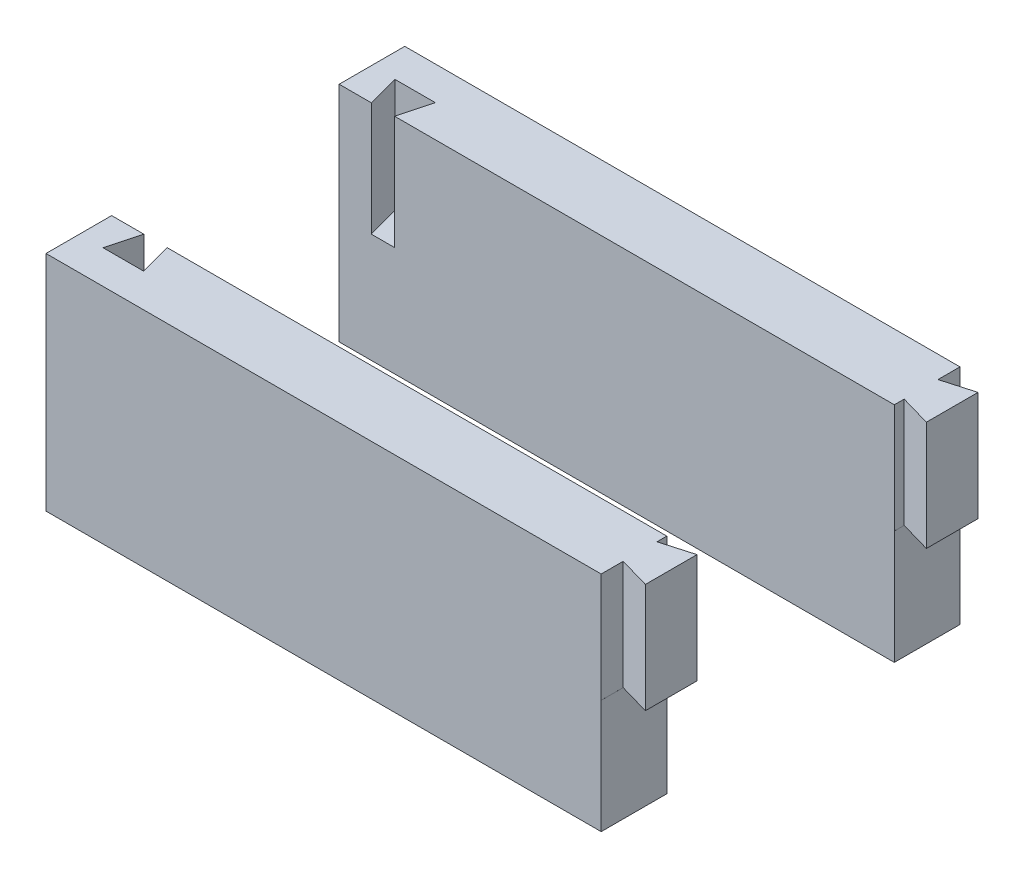
ISO-10303-21;
HEADER;
FILE_DESCRIPTION(('STEP AP214'),'2;1');
FILE_NAME('part.step','',(''),(''),'','','');
FILE_SCHEMA(('AUTOMOTIVE_DESIGN { 1 0 10303 214 1 1 1 1 }'));
ENDSEC;
DATA;
#1=APPLICATION_CONTEXT('core data for automotive mechanical design processes');
#2=APPLICATION_PROTOCOL_DEFINITION('international standard','automotive_design',2000,#1);
#3=PRODUCT_CONTEXT('',#1,'mechanical');
#4=PRODUCT('Part','Part','',(#3));
#5=PRODUCT_RELATED_PRODUCT_CATEGORY('part','',(#4));
#6=PRODUCT_DEFINITION_FORMATION('','',#4);
#7=PRODUCT_DEFINITION_CONTEXT('part definition',#1,'design');
#8=PRODUCT_DEFINITION('design','',#6,#7);
#9=PRODUCT_DEFINITION_SHAPE('','',#8);
#10=(LENGTH_UNIT() NAMED_UNIT(*) SI_UNIT(.MILLI.,.METRE.));
#11=(NAMED_UNIT(*) PLANE_ANGLE_UNIT() SI_UNIT($,.RADIAN.));
#12=(NAMED_UNIT(*) SI_UNIT($,.STERADIAN.) SOLID_ANGLE_UNIT());
#13=UNCERTAINTY_MEASURE_WITH_UNIT(LENGTH_MEASURE(1.E-05),#10,'distance_accuracy_value','');
#14=(GEOMETRIC_REPRESENTATION_CONTEXT(3) GLOBAL_UNCERTAINTY_ASSIGNED_CONTEXT((#13)) GLOBAL_UNIT_ASSIGNED_CONTEXT((#10,
#11,#12)) REPRESENTATION_CONTEXT('',''));
#15=CARTESIAN_POINT('',(0.,0.,0.));
#16=DIRECTION('',(0.,0.,1.));
#17=DIRECTION('',(1.,0.,0.));
#18=AXIS2_PLACEMENT_3D('',#15,#16,#17);
#19=CARTESIAN_POINT('',(-60.9366197183099,28.612676056338,-67.));
#20=DIRECTION('',(1.,0.,0.));
#21=DIRECTION('',(0.,0.,1.));
#22=AXIS2_PLACEMENT_3D('',#19,#20,#21);
#23=PLANE('',#22);
#24=DIRECTION('',(0.,-1.,0.));
#25=VECTOR('',#24,1.);
#26=CARTESIAN_POINT('',(-60.9366197183099,28.612676056338,-52.));
#27=LINE('',#26,#25);
#28=CARTESIAN_POINT('',(-60.9366197183099,28.612676056338,-52.));
#29=VERTEX_POINT('',#28);
#30=CARTESIAN_POINT('',(-60.9366197183099,-22.387323943662,-52.));
#31=VERTEX_POINT('',#30);
#32=EDGE_CURVE('E285',#29,#31,#27,.T.);
#33=ORIENTED_EDGE('',*,*,#32,.F.);
#34=DIRECTION('',(0.,0.,1.));
#35=VECTOR('',#34,1.);
#36=CARTESIAN_POINT('',(-60.9366197183099,28.612676056338,-67.));
#37=LINE('',#36,#35);
#38=CARTESIAN_POINT('',(-60.9366197183099,28.612676056338,-67.));
#39=VERTEX_POINT('',#38);
#40=EDGE_CURVE('E301',#39,#29,#37,.T.);
#41=ORIENTED_EDGE('',*,*,#40,.F.);
#42=DIRECTION('',(0.,-1.,0.));
#43=VECTOR('',#42,1.);
#44=CARTESIAN_POINT('',(-60.9366197183099,28.612676056338,-67.));
#45=LINE('',#44,#43);
#46=CARTESIAN_POINT('',(-60.9366197183099,-22.387323943662,-67.));
#47=VERTEX_POINT('',#46);
#48=EDGE_CURVE('E289',#39,#47,#45,.T.);
#49=ORIENTED_EDGE('',*,*,#48,.T.);
#50=DIRECTION('',(0.,0.,1.));
#51=VECTOR('',#50,1.);
#52=CARTESIAN_POINT('',(-60.9366197183099,-22.387323943662,-67.));
#53=LINE('',#52,#51);
#54=EDGE_CURVE('E12',#47,#31,#53,.T.);
#55=ORIENTED_EDGE('',*,*,#54,.T.);
#56=EDGE_LOOP('',(#33,#41,#49,#55));
#57=FACE_BOUND('',#56,.T.);
#58=ADVANCED_FACE('F56',(#57),#23,.F.);
#59=CARTESIAN_POINT('',(-60.9366197183099,-22.387323943662,-67.));
#60=DIRECTION('',(0.,1.,0.));
#61=DIRECTION('',(0.,0.,-1.));
#62=AXIS2_PLACEMENT_3D('',#59,#60,#61);
#63=PLANE('',#62);
#64=DIRECTION('',(1.,0.,0.));
#65=VECTOR('',#64,1.);
#66=CARTESIAN_POINT('',(-60.9366197183099,-22.387323943662,-52.));
#67=LINE('',#66,#65);
#68=CARTESIAN_POINT('',(65.9533802816901,-22.387323943662,-52.));
#69=VERTEX_POINT('',#68);
#70=EDGE_CURVE('E181',#31,#69,#67,.T.);
#71=ORIENTED_EDGE('',*,*,#70,.F.);
#72=ORIENTED_EDGE('',*,*,#54,.F.);
#73=DIRECTION('',(1.,0.,0.));
#74=VECTOR('',#73,1.);
#75=CARTESIAN_POINT('',(-60.9366197183099,-22.387323943662,-67.));
#76=LINE('',#75,#74);
#77=CARTESIAN_POINT('',(65.9533802816901,-22.387323943662,-67.));
#78=VERTEX_POINT('',#77);
#79=EDGE_CURVE('E293',#47,#78,#76,.T.);
#80=ORIENTED_EDGE('',*,*,#79,.T.);
#81=DIRECTION('',(0.,0.,1.));
#82=VECTOR('',#81,1.);
#83=CARTESIAN_POINT('',(65.9533802816901,-22.387323943662,-52.));
#84=LINE('',#83,#82);
#85=EDGE_CURVE('E172',#78,#69,#84,.T.);
#86=ORIENTED_EDGE('',*,*,#85,.T.);
#87=EDGE_LOOP('',(#71,#72,#80,#86));
#88=FACE_BOUND('',#87,.T.);
#89=ADVANCED_FACE('F361',(#88),#63,.F.);
#90=CARTESIAN_POINT('',(73.0633802816902,28.612676056338,-67.));
#91=DIRECTION('',(-1.,0.,0.));
#92=DIRECTION('',(0.,0.,-1.));
#93=AXIS2_PLACEMENT_3D('',#90,#91,#92);
#94=PLANE('',#93);
#95=DIRECTION('',(0.,1.,0.));
#96=VECTOR('',#95,1.);
#97=CARTESIAN_POINT('',(73.0633802816902,3.61267605633802,-64.0102835669542));
#98=LINE('',#97,#96);
#99=CARTESIAN_POINT('',(73.0633802816902,3.61267605633802,-64.0102835669542));
#100=VERTEX_POINT('',#99);
#101=CARTESIAN_POINT('',(73.0633802816902,28.612676056338,-64.0102835669542));
#102=VERTEX_POINT('',#101);
#103=EDGE_CURVE('E217',#100,#102,#98,.T.);
#104=ORIENTED_EDGE('',*,*,#103,.T.);
#105=DIRECTION('',(0.,0.,1.));
#106=VECTOR('',#105,1.);
#107=CARTESIAN_POINT('',(73.0633802816902,28.612676056338,-67.));
#108=LINE('',#107,#106);
#109=CARTESIAN_POINT('',(73.0633802816902,28.612676056338,-52.2102835669542));
#110=VERTEX_POINT('',#109);
#111=EDGE_CURVE('E64',#102,#110,#108,.T.);
#112=ORIENTED_EDGE('',*,*,#111,.T.);
#113=DIRECTION('',(0.,1.,0.));
#114=VECTOR('',#113,1.);
#115=CARTESIAN_POINT('',(73.0633802816902,3.61267605633802,-52.2102835669542));
#116=LINE('',#115,#114);
#117=CARTESIAN_POINT('',(73.0633802816902,3.61267605633802,-52.2102835669542));
#118=VERTEX_POINT('',#117);
#119=EDGE_CURVE('E196',#118,#110,#116,.T.);
#120=ORIENTED_EDGE('',*,*,#119,.F.);
#121=DIRECTION('',(0.,0.,-1.));
#122=VECTOR('',#121,1.);
#123=CARTESIAN_POINT('',(73.0633802816902,3.61267605633802,-52.));
#124=LINE('',#123,#122);
#125=EDGE_CURVE('E184',#118,#100,#124,.T.);
#126=ORIENTED_EDGE('',*,*,#125,.T.);
#127=EDGE_LOOP('',(#104,#112,#120,#126));
#128=FACE_BOUND('',#127,.T.);
#129=ADVANCED_FACE('F317',(#128),#94,.F.);
#130=CARTESIAN_POINT('',(-60.9366197183099,28.612676056338,-67.));
#131=DIRECTION('',(0.,-1.,0.));
#132=DIRECTION('',(0.,0.,1.));
#133=AXIS2_PLACEMENT_3D('',#130,#131,#132);
#134=PLANE('',#133);
#135=DIRECTION('',(0.961261695938317,0.,0.275637355817005));
#136=VECTOR('',#135,1.);
#137=CARTESIAN_POINT('',(73.0633802816902,28.612676056338,-52.2102835669542));
#138=LINE('',#137,#136);
#139=CARTESIAN_POINT('',(65.9500437317466,28.612676056338,-54.25));
#140=VERTEX_POINT('',#139);
#141=EDGE_CURVE('E206',#140,#110,#138,.T.);
#142=ORIENTED_EDGE('',*,*,#141,.T.);
#143=ORIENTED_EDGE('',*,*,#111,.F.);
#144=DIRECTION('',(-0.961261695938318,0.,0.275637355817004));
#145=VECTOR('',#144,1.);
#146=CARTESIAN_POINT('',(65.9500437317466,28.612676056338,-61.9705671339084));
#147=LINE('',#146,#145);
#148=CARTESIAN_POINT('',(65.9500437317466,28.612676056338,-61.9705671339084));
#149=VERTEX_POINT('',#148);
#150=EDGE_CURVE('E207',#102,#149,#147,.T.);
#151=ORIENTED_EDGE('',*,*,#150,.T.);
#152=DIRECTION('',(0.,0.,-1.));
#153=VECTOR('',#152,1.);
#154=CARTESIAN_POINT('',(65.9500437317466,28.612676056338,-67.));
#155=LINE('',#154,#153);
#156=CARTESIAN_POINT('',(65.9500437317466,28.612676056338,-67.));
#157=VERTEX_POINT('',#156);
#158=EDGE_CURVE('E228',#149,#157,#155,.T.);
#159=ORIENTED_EDGE('',*,*,#158,.T.);
#160=DIRECTION('',(-1.,0.,0.));
#161=VECTOR('',#160,1.);
#162=CARTESIAN_POINT('',(-60.9366197183099,28.612676056338,-67.));
#163=LINE('',#162,#161);
#164=EDGE_CURVE('E298',#157,#39,#163,.T.);
#165=ORIENTED_EDGE('',*,*,#164,.T.);
#166=ORIENTED_EDGE('',*,*,#40,.T.);
#167=DIRECTION('',(-1.,0.,0.));
#168=VECTOR('',#167,1.);
#169=CARTESIAN_POINT('',(-60.9366197183099,28.612676056338,-52.));
#170=LINE('',#169,#168);
#171=CARTESIAN_POINT('',(-53.5866197183098,28.6126760563381,-52.));
#172=VERTEX_POINT('',#171);
#173=EDGE_CURVE('E306',#172,#29,#170,.T.);
#174=ORIENTED_EDGE('',*,*,#173,.F.);
#175=DIRECTION('',(0.258819045102518,0.,0.965925826289069));
#176=VECTOR('',#175,1.);
#177=CARTESIAN_POINT('',(-53.5866197183098,28.612676056338,-52.));
#178=LINE('',#177,#176);
#179=CARTESIAN_POINT('',(-55.553644461089,28.6126760563381,-59.3410362797969));
#180=VERTEX_POINT('',#179);
#181=EDGE_CURVE('E255',#180,#172,#178,.T.);
#182=ORIENTED_EDGE('',*,*,#181,.F.);
#183=DIRECTION('',(-1.,0.,0.));
#184=VECTOR('',#183,1.);
#185=CARTESIAN_POINT('',(-55.553644461089,28.612676056338,-59.3410362797969));
#186=LINE('',#185,#184);
#187=CARTESIAN_POINT('',(-46.3195949755307,28.6126760563381,-59.3410362797969));
#188=VERTEX_POINT('',#187);
#189=EDGE_CURVE('E263',#188,#180,#186,.T.);
#190=ORIENTED_EDGE('',*,*,#189,.F.);
#191=DIRECTION('',(0.258819045102518,0.,-0.965925826289069));
#192=VECTOR('',#191,1.);
#193=CARTESIAN_POINT('',(-46.3195949755307,28.612676056338,-59.3410362797969));
#194=LINE('',#193,#192);
#195=CARTESIAN_POINT('',(-48.2866197183099,28.6126760563381,-52.));
#196=VERTEX_POINT('',#195);
#197=EDGE_CURVE('E259',#196,#188,#194,.T.);
#198=ORIENTED_EDGE('',*,*,#197,.F.);
#199=CARTESIAN_POINT('',(65.9500437317466,28.612676056338,-52.));
#200=VERTEX_POINT('',#199);
#201=EDGE_CURVE('E294',#200,#196,#170,.T.);
#202=ORIENTED_EDGE('',*,*,#201,.F.);
#203=DIRECTION('',(0.,0.,-1.));
#204=VECTOR('',#203,1.);
#205=CARTESIAN_POINT('',(65.9500437317466,28.612676056338,-54.25));
#206=LINE('',#205,#204);
#207=EDGE_CURVE('E202',#200,#140,#206,.T.);
#208=ORIENTED_EDGE('',*,*,#207,.T.);
#209=EDGE_LOOP('',(#142,#143,#151,#159,#165,#166,#174,#182,#190,#198,#202,#208));
#210=FACE_BOUND('',#209,.T.);
#211=ADVANCED_FACE('F321',(#210),#134,.F.);
#212=CARTESIAN_POINT('',(0.,0.,-67.));
#213=DIRECTION('',(0.,0.,-1.));
#214=DIRECTION('',(1.,0.,0.));
#215=AXIS2_PLACEMENT_3D('',#212,#213,#214);
#216=PLANE('',#215);
#217=DIRECTION('',(0.,-1.,0.));
#218=VECTOR('',#217,1.);
#219=CARTESIAN_POINT('',(65.9533802816901,3.61267605633802,-67.));
#220=LINE('',#219,#218);
#221=CARTESIAN_POINT('',(65.9533802816901,3.61267605633802,-67.));
#222=VERTEX_POINT('',#221);
#223=EDGE_CURVE('E183',#222,#78,#220,.T.);
#224=ORIENTED_EDGE('',*,*,#223,.T.);
#225=ORIENTED_EDGE('',*,*,#79,.F.);
#226=ORIENTED_EDGE('',*,*,#48,.F.);
#227=ORIENTED_EDGE('',*,*,#164,.F.);
#228=DIRECTION('',(0.,1.,0.));
#229=VECTOR('',#228,1.);
#230=CARTESIAN_POINT('',(65.9500437317466,3.61267605633802,-67.));
#231=LINE('',#230,#229);
#232=CARTESIAN_POINT('',(65.9500437317466,3.61267605633802,-67.));
#233=VERTEX_POINT('',#232);
#234=EDGE_CURVE('E224',#233,#157,#231,.T.);
#235=ORIENTED_EDGE('',*,*,#234,.F.);
#236=DIRECTION('',(1.,0.,0.));
#237=VECTOR('',#236,1.);
#238=CARTESIAN_POINT('',(73.0633802816902,3.61267605633802,-67.));
#239=LINE('',#238,#237);
#240=EDGE_CURVE('E232',#233,#222,#239,.T.);
#241=ORIENTED_EDGE('',*,*,#240,.T.);
#242=EDGE_LOOP('',(#224,#225,#226,#227,#235,#241));
#243=FACE_BOUND('',#242,.T.);
#244=ADVANCED_FACE('F365',(#243),#216,.T.);
#245=CARTESIAN_POINT('',(0.,0.,-52.));
#246=DIRECTION('',(0.,0.,-1.));
#247=DIRECTION('',(1.,0.,0.));
#248=AXIS2_PLACEMENT_3D('',#245,#246,#247);
#249=PLANE('',#248);
#250=DIRECTION('',(-1.,0.,0.));
#251=VECTOR('',#250,1.);
#252=CARTESIAN_POINT('',(65.9500437317466,3.61267605633802,-52.));
#253=LINE('',#252,#251);
#254=CARTESIAN_POINT('',(65.9533802816901,3.61267605633802,-52.));
#255=VERTEX_POINT('',#254);
#256=CARTESIAN_POINT('',(65.9500437317466,3.61267605633802,-52.));
#257=VERTEX_POINT('',#256);
#258=EDGE_CURVE('E179',#255,#257,#253,.T.);
#259=ORIENTED_EDGE('',*,*,#258,.T.);
#260=DIRECTION('',(0.,1.,0.));
#261=VECTOR('',#260,1.);
#262=CARTESIAN_POINT('',(65.9500437317466,3.61267605633802,-52.));
#263=LINE('',#262,#261);
#264=EDGE_CURVE('E210',#257,#200,#263,.T.);
#265=ORIENTED_EDGE('',*,*,#264,.T.);
#266=ORIENTED_EDGE('',*,*,#201,.T.);
#267=DIRECTION('',(0.,-1.,0.));
#268=VECTOR('',#267,1.);
#269=CARTESIAN_POINT('',(-48.2866197183099,272.562218231117,-52.));
#270=LINE('',#269,#268);
#271=CARTESIAN_POINT('',(-48.2866197183099,2.61267605633802,-52.));
#272=VERTEX_POINT('',#271);
#273=EDGE_CURVE('E277',#196,#272,#270,.T.);
#274=ORIENTED_EDGE('',*,*,#273,.T.);
#275=DIRECTION('',(-1.,0.,0.));
#276=VECTOR('',#275,1.);
#277=CARTESIAN_POINT('',(-60.9366197183099,2.61267605633802,-52.));
#278=LINE('',#277,#276);
#279=CARTESIAN_POINT('',(-53.5866197183098,2.61267605633808,-52.));
#280=VERTEX_POINT('',#279);
#281=EDGE_CURVE('E213',#272,#280,#278,.T.);
#282=ORIENTED_EDGE('',*,*,#281,.T.);
#283=DIRECTION('',(0.,-1.,0.));
#284=VECTOR('',#283,1.);
#285=CARTESIAN_POINT('',(-53.5866197183098,272.562218231117,-52.));
#286=LINE('',#285,#284);
#287=EDGE_CURVE('E250',#172,#280,#286,.T.);
#288=ORIENTED_EDGE('',*,*,#287,.F.);
#289=ORIENTED_EDGE('',*,*,#173,.T.);
#290=ORIENTED_EDGE('',*,*,#32,.T.);
#291=ORIENTED_EDGE('',*,*,#70,.T.);
#292=DIRECTION('',(0.,-1.,0.));
#293=VECTOR('',#292,1.);
#294=CARTESIAN_POINT('',(65.9533802816901,3.61267605633802,-52.));
#295=LINE('',#294,#293);
#296=EDGE_CURVE('E167',#255,#69,#295,.T.);
#297=ORIENTED_EDGE('',*,*,#296,.F.);
#298=EDGE_LOOP('',(#259,#265,#266,#274,#282,#288,#289,#290,#291,#297));
#299=FACE_BOUND('',#298,.T.);
#300=ADVANCED_FACE('F178',(#299),#249,.F.);
#301=CARTESIAN_POINT('',(-46.3195949755307,272.562218231117,-59.3410362797969));
#302=DIRECTION('',(-0.965925826289069,0.,-0.258819045102518));
#303=DIRECTION('',(0.258819045102518,0.,-0.965925826289069));
#304=AXIS2_PLACEMENT_3D('',#301,#302,#303);
#305=PLANE('',#304);
#306=ORIENTED_EDGE('',*,*,#197,.T.);
#307=DIRECTION('',(0.,-1.,0.));
#308=VECTOR('',#307,1.);
#309=CARTESIAN_POINT('',(-46.3195949755307,272.562218231117,-59.3410362797969));
#310=LINE('',#309,#308);
#311=CARTESIAN_POINT('',(-46.3195949755307,2.61267605633808,-59.3410362797969));
#312=VERTEX_POINT('',#311);
#313=EDGE_CURVE('E281',#188,#312,#310,.T.);
#314=ORIENTED_EDGE('',*,*,#313,.T.);
#315=DIRECTION('',(0.258819045102518,0.,-0.965925826289069));
#316=VECTOR('',#315,1.);
#317=CARTESIAN_POINT('',(-46.3195949755307,2.61267605633803,-59.3410362797969));
#318=LINE('',#317,#316);
#319=EDGE_CURVE('E246',#272,#312,#318,.T.);
#320=ORIENTED_EDGE('',*,*,#319,.F.);
#321=ORIENTED_EDGE('',*,*,#273,.F.);
#322=EDGE_LOOP('',(#306,#314,#320,#321));
#323=FACE_BOUND('',#322,.T.);
#324=ADVANCED_FACE('F346',(#323),#305,.T.);
#325=CARTESIAN_POINT('',(-55.553644461089,272.562218231117,-59.3410362797969));
#326=DIRECTION('',(0.,0.,1.));
#327=DIRECTION('',(-1.,0.,0.));
#328=AXIS2_PLACEMENT_3D('',#325,#326,#327);
#329=PLANE('',#328);
#330=ORIENTED_EDGE('',*,*,#189,.T.);
#331=DIRECTION('',(0.,-1.,0.));
#332=VECTOR('',#331,1.);
#333=CARTESIAN_POINT('',(-55.553644461089,272.562218231117,-59.3410362797969));
#334=LINE('',#333,#332);
#335=CARTESIAN_POINT('',(-55.553644461089,2.61267605633808,-59.3410362797969));
#336=VERTEX_POINT('',#335);
#337=EDGE_CURVE('E273',#180,#336,#334,.T.);
#338=ORIENTED_EDGE('',*,*,#337,.T.);
#339=DIRECTION('',(-1.,0.,0.));
#340=VECTOR('',#339,1.);
#341=CARTESIAN_POINT('',(-55.553644461089,2.61267605633803,-59.3410362797969));
#342=LINE('',#341,#340);
#343=EDGE_CURVE('E251',#312,#336,#342,.T.);
#344=ORIENTED_EDGE('',*,*,#343,.F.);
#345=ORIENTED_EDGE('',*,*,#313,.F.);
#346=EDGE_LOOP('',(#330,#338,#344,#345));
#347=FACE_BOUND('',#346,.T.);
#348=ADVANCED_FACE('F402',(#347),#329,.T.);
#349=CARTESIAN_POINT('',(-53.5866197183098,272.562218231117,-52.));
#350=DIRECTION('',(0.965925826289069,0.,-0.258819045102518));
#351=DIRECTION('',(0.258819045102518,0.,0.965925826289069));
#352=AXIS2_PLACEMENT_3D('',#349,#350,#351);
#353=PLANE('',#352);
#354=ORIENTED_EDGE('',*,*,#181,.T.);
#355=ORIENTED_EDGE('',*,*,#287,.T.);
#356=DIRECTION('',(0.258819045102518,0.,0.965925826289069));
#357=VECTOR('',#356,1.);
#358=CARTESIAN_POINT('',(-53.5866197183098,2.61267605633803,-52.));
#359=LINE('',#358,#357);
#360=EDGE_CURVE('E252',#336,#280,#359,.T.);
#361=ORIENTED_EDGE('',*,*,#360,.F.);
#362=ORIENTED_EDGE('',*,*,#337,.F.);
#363=EDGE_LOOP('',(#354,#355,#361,#362));
#364=FACE_BOUND('',#363,.T.);
#365=ADVANCED_FACE('F352',(#364),#353,.T.);
#366=CARTESIAN_POINT('',(-60.9366197183099,2.61267605633802,-67.));
#367=DIRECTION('',(0.,-1.,0.));
#368=DIRECTION('',(0.,0.,1.));
#369=AXIS2_PLACEMENT_3D('',#366,#367,#368);
#370=PLANE('',#369);
#371=ORIENTED_EDGE('',*,*,#281,.F.);
#372=ORIENTED_EDGE('',*,*,#319,.T.);
#373=ORIENTED_EDGE('',*,*,#343,.T.);
#374=ORIENTED_EDGE('',*,*,#360,.T.);
#375=EDGE_LOOP('',(#371,#372,#373,#374));
#376=FACE_BOUND('',#375,.T.);
#377=ADVANCED_FACE('F349',(#376),#370,.F.);
#378=CARTESIAN_POINT('',(65.9500437317466,3.61267605633802,-54.25));
#379=DIRECTION('',(-1.,0.,0.));
#380=DIRECTION('',(0.,0.,-1.));
#381=AXIS2_PLACEMENT_3D('',#378,#379,#380);
#382=PLANE('',#381);
#383=ORIENTED_EDGE('',*,*,#207,.F.);
#384=ORIENTED_EDGE('',*,*,#264,.F.);
#385=DIRECTION('',(0.,0.,-1.));
#386=VECTOR('',#385,1.);
#387=CARTESIAN_POINT('',(65.9500437317466,3.61267605633802,-54.25));
#388=LINE('',#387,#386);
#389=CARTESIAN_POINT('',(65.9500437317466,3.61267605633802,-54.25));
#390=VERTEX_POINT('',#389);
#391=EDGE_CURVE('E188',#257,#390,#388,.T.);
#392=ORIENTED_EDGE('',*,*,#391,.T.);
#393=DIRECTION('',(0.,1.,0.));
#394=VECTOR('',#393,1.);
#395=CARTESIAN_POINT('',(65.9500437317466,3.61267605633802,-54.25));
#396=LINE('',#395,#394);
#397=EDGE_CURVE('E191',#390,#140,#396,.T.);
#398=ORIENTED_EDGE('',*,*,#397,.T.);
#399=EDGE_LOOP('',(#383,#384,#392,#398));
#400=FACE_BOUND('',#399,.T.);
#401=ADVANCED_FACE('F341',(#400),#382,.F.);
#402=CARTESIAN_POINT('',(73.0633802816902,3.61267605633802,-52.2102835669542));
#403=DIRECTION('',(0.275637355817005,0.,-0.961261695938317));
#404=DIRECTION('',(0.961261695938317,0.,0.275637355817005));
#405=AXIS2_PLACEMENT_3D('',#402,#403,#404);
#406=PLANE('',#405);
#407=ORIENTED_EDGE('',*,*,#141,.F.);
#408=ORIENTED_EDGE('',*,*,#397,.F.);
#409=DIRECTION('',(0.961261695938317,0.,0.275637355817005));
#410=VECTOR('',#409,1.);
#411=CARTESIAN_POINT('',(73.0633802816902,3.61267605633802,-52.2102835669542));
#412=LINE('',#411,#410);
#413=CARTESIAN_POINT('',(65.9533802816901,3.61267605633802,-54.2490432596993));
#414=VERTEX_POINT('',#413);
#415=EDGE_CURVE('E192',#390,#414,#412,.T.);
#416=ORIENTED_EDGE('',*,*,#415,.T.);
#417=DIRECTION('',(-0.961261695938317,0.,-0.275637355817005));
#418=VECTOR('',#417,1.);
#419=CARTESIAN_POINT('',(73.0633802816902,3.61267605633802,-52.2102835669542));
#420=LINE('',#419,#418);
#421=EDGE_CURVE('E227',#118,#414,#420,.T.);
#422=ORIENTED_EDGE('',*,*,#421,.F.);
#423=ORIENTED_EDGE('',*,*,#119,.T.);
#424=EDGE_LOOP('',(#407,#408,#416,#422,#423));
#425=FACE_BOUND('',#424,.T.);
#426=ADVANCED_FACE('F327',(#425),#406,.F.);
#427=CARTESIAN_POINT('',(0.,3.61267605633802,-52.));
#428=DIRECTION('',(0.,-1.,0.));
#429=DIRECTION('',(0.,0.,1.));
#430=AXIS2_PLACEMENT_3D('',#427,#428,#429);
#431=PLANE('',#430);
#432=ORIENTED_EDGE('',*,*,#415,.F.);
#433=ORIENTED_EDGE('',*,*,#391,.F.);
#434=ORIENTED_EDGE('',*,*,#258,.F.);
#435=DIRECTION('',(0.,0.,1.));
#436=VECTOR('',#435,1.);
#437=CARTESIAN_POINT('',(65.9533802816901,3.61267605633802,-52.));
#438=LINE('',#437,#436);
#439=EDGE_CURVE('E163',#414,#255,#438,.T.);
#440=ORIENTED_EDGE('',*,*,#439,.F.);
#441=EDGE_LOOP('',(#432,#433,#434,#440));
#442=FACE_BOUND('',#441,.T.);
#443=ADVANCED_FACE('F186',(#442),#431,.F.);
#444=CARTESIAN_POINT('',(65.9500437317466,3.61267605633802,-67.));
#445=DIRECTION('',(-1.,0.,0.));
#446=DIRECTION('',(0.,0.,-1.));
#447=AXIS2_PLACEMENT_3D('',#444,#445,#446);
#448=PLANE('',#447);
#449=ORIENTED_EDGE('',*,*,#158,.F.);
#450=DIRECTION('',(0.,1.,0.));
#451=VECTOR('',#450,1.);
#452=CARTESIAN_POINT('',(65.9500437317466,3.61267605633802,-61.9705671339084));
#453=LINE('',#452,#451);
#454=CARTESIAN_POINT('',(65.9500437317466,3.61267605633802,-61.9705671339084));
#455=VERTEX_POINT('',#454);
#456=EDGE_CURVE('E221',#455,#149,#453,.T.);
#457=ORIENTED_EDGE('',*,*,#456,.F.);
#458=DIRECTION('',(0.,0.,-1.));
#459=VECTOR('',#458,1.);
#460=CARTESIAN_POINT('',(65.9500437317466,3.61267605633802,-67.));
#461=LINE('',#460,#459);
#462=EDGE_CURVE('E79',#455,#233,#461,.T.);
#463=ORIENTED_EDGE('',*,*,#462,.T.);
#464=ORIENTED_EDGE('',*,*,#234,.T.);
#465=EDGE_LOOP('',(#449,#457,#463,#464));
#466=FACE_BOUND('',#465,.T.);
#467=ADVANCED_FACE('F373',(#466),#448,.F.);
#468=CARTESIAN_POINT('',(65.9500437317466,3.61267605633802,-61.9705671339084));
#469=DIRECTION('',(0.275637355817004,0.,0.961261695938318));
#470=DIRECTION('',(-0.961261695938318,0.,0.275637355817004));
#471=AXIS2_PLACEMENT_3D('',#468,#469,#470);
#472=PLANE('',#471);
#473=ORIENTED_EDGE('',*,*,#150,.F.);
#474=ORIENTED_EDGE('',*,*,#103,.F.);
#475=DIRECTION('',(-0.961261695938318,0.,0.275637355817004));
#476=VECTOR('',#475,1.);
#477=CARTESIAN_POINT('',(65.9500437317466,3.61267605633802,-61.9705671339084));
#478=LINE('',#477,#476);
#479=CARTESIAN_POINT('',(65.9533802816901,3.61267605633802,-61.971523874209));
#480=VERTEX_POINT('',#479);
#481=EDGE_CURVE('E239',#100,#480,#478,.T.);
#482=ORIENTED_EDGE('',*,*,#481,.T.);
#483=EDGE_CURVE('E238',#480,#455,#478,.T.);
#484=ORIENTED_EDGE('',*,*,#483,.T.);
#485=ORIENTED_EDGE('',*,*,#456,.T.);
#486=EDGE_LOOP('',(#473,#474,#482,#484,#485));
#487=FACE_BOUND('',#486,.T.);
#488=ADVANCED_FACE('F371',(#487),#472,.F.);
#489=CARTESIAN_POINT('',(0.,3.61267605633802,-52.));
#490=DIRECTION('',(0.,-1.,0.));
#491=DIRECTION('',(0.,0.,1.));
#492=AXIS2_PLACEMENT_3D('',#489,#490,#491);
#493=PLANE('',#492);
#494=ORIENTED_EDGE('',*,*,#240,.F.);
#495=ORIENTED_EDGE('',*,*,#462,.F.);
#496=ORIENTED_EDGE('',*,*,#483,.F.);
#497=EDGE_CURVE('E174',#222,#480,#438,.T.);
#498=ORIENTED_EDGE('',*,*,#497,.F.);
#499=EDGE_LOOP('',(#494,#495,#496,#498));
#500=FACE_BOUND('',#499,.T.);
#501=ADVANCED_FACE('F368',(#500),#493,.F.);
#502=CARTESIAN_POINT('',(0.,3.61267605633802,-52.));
#503=DIRECTION('',(0.,1.,0.));
#504=DIRECTION('',(0.,0.,-1.));
#505=AXIS2_PLACEMENT_3D('',#502,#503,#504);
#506=PLANE('',#505);
#507=ORIENTED_EDGE('',*,*,#125,.F.);
#508=ORIENTED_EDGE('',*,*,#421,.T.);
#509=EDGE_CURVE('E71',#480,#414,#438,.T.);
#510=ORIENTED_EDGE('',*,*,#509,.F.);
#511=ORIENTED_EDGE('',*,*,#481,.F.);
#512=EDGE_LOOP('',(#507,#508,#510,#511));
#513=FACE_BOUND('',#512,.T.);
#514=ADVANCED_FACE('F331',(#513),#506,.F.);
#515=CARTESIAN_POINT('',(65.9533802816901,3.61267605633802,-52.));
#516=DIRECTION('',(-1.,0.,0.));
#517=DIRECTION('',(0.,0.,-1.));
#518=AXIS2_PLACEMENT_3D('',#515,#516,#517);
#519=PLANE('',#518);
#520=ORIENTED_EDGE('',*,*,#85,.F.);
#521=ORIENTED_EDGE('',*,*,#223,.F.);
#522=ORIENTED_EDGE('',*,*,#497,.T.);
#523=ORIENTED_EDGE('',*,*,#509,.T.);
#524=ORIENTED_EDGE('',*,*,#439,.T.);
#525=ORIENTED_EDGE('',*,*,#296,.T.);
#526=EDGE_LOOP('',(#520,#521,#522,#523,#524,#525));
#527=FACE_BOUND('',#526,.T.);
#528=ADVANCED_FACE('F166',(#527),#519,.F.);
#529=CLOSED_SHELL('',(#58,#89,#129,#211,#244,#300,#324,#348,#365,#377,#401,#426,#443,#467,#488,
#501,#514,#528));
#530=MANIFOLD_SOLID_BREP('B2_NOT_SHOWN',#529);
#531=CARTESIAN_POINT('',(-60.9366197183099,28.612676056338,15.));
#532=DIRECTION('',(1.,0.,0.));
#533=DIRECTION('',(0.,0.,-1.));
#534=AXIS2_PLACEMENT_3D('',#531,#532,#533);
#535=PLANE('',#534);
#536=DIRECTION('',(0.,-1.,0.));
#537=VECTOR('',#536,1.);
#538=CARTESIAN_POINT('',(-60.9366197183099,28.612676056338,0.));
#539=LINE('',#538,#537);
#540=CARTESIAN_POINT('',(-60.9366197183099,28.612676056338,0.));
#541=VERTEX_POINT('',#540);
#542=CARTESIAN_POINT('',(-60.9366197183099,-22.387323943662,0.));
#543=VERTEX_POINT('',#542);
#544=EDGE_CURVE('E759',#541,#543,#539,.T.);
#545=ORIENTED_EDGE('',*,*,#544,.T.);
#546=DIRECTION('',(0.,0.,-1.));
#547=VECTOR('',#546,1.);
#548=CARTESIAN_POINT('',(-60.9366197183099,-22.387323943662,15.));
#549=LINE('',#548,#547);
#550=CARTESIAN_POINT('',(-60.9366197183099,-22.387323943662,15.));
#551=VERTEX_POINT('',#550);
#552=EDGE_CURVE('E54',#551,#543,#549,.T.);
#553=ORIENTED_EDGE('',*,*,#552,.F.);
#554=DIRECTION('',(0.,-1.,0.));
#555=VECTOR('',#554,1.);
#556=CARTESIAN_POINT('',(-60.9366197183099,28.612676056338,15.));
#557=LINE('',#556,#555);
#558=CARTESIAN_POINT('',(-60.9366197183099,28.612676056338,15.));
#559=VERTEX_POINT('',#558);
#560=EDGE_CURVE('E761',#559,#551,#557,.T.);
#561=ORIENTED_EDGE('',*,*,#560,.F.);
#562=DIRECTION('',(0.,0.,-1.));
#563=VECTOR('',#562,1.);
#564=CARTESIAN_POINT('',(-60.9366197183099,28.612676056338,15.));
#565=LINE('',#564,#563);
#566=EDGE_CURVE('E770',#559,#541,#565,.T.);
#567=ORIENTED_EDGE('',*,*,#566,.T.);
#568=EDGE_LOOP('',(#545,#553,#561,#567));
#569=FACE_BOUND('',#568,.T.);
#570=ADVANCED_FACE('F562',(#569),#535,.F.);
#571=CARTESIAN_POINT('',(-60.9366197183099,-22.387323943662,15.));
#572=DIRECTION('',(0.,1.,0.));
#573=DIRECTION('',(0.,0.,1.));
#574=AXIS2_PLACEMENT_3D('',#571,#572,#573);
#575=PLANE('',#574);
#576=DIRECTION('',(1.,0.,0.));
#577=VECTOR('',#576,1.);
#578=CARTESIAN_POINT('',(-60.9366197183099,-22.387323943662,0.));
#579=LINE('',#578,#577);
#580=CARTESIAN_POINT('',(65.9533802816901,-22.387323943662,0.));
#581=VERTEX_POINT('',#580);
#582=EDGE_CURVE('E772',#543,#581,#579,.T.);
#583=ORIENTED_EDGE('',*,*,#582,.T.);
#584=DIRECTION('',(0.,0.,-1.));
#585=VECTOR('',#584,1.);
#586=CARTESIAN_POINT('',(65.9533802816901,-22.387323943662,0.));
#587=LINE('',#586,#585);
#588=CARTESIAN_POINT('',(65.9533802816901,-22.387323943662,15.));
#589=VERTEX_POINT('',#588);
#590=EDGE_CURVE('E672',#589,#581,#587,.T.);
#591=ORIENTED_EDGE('',*,*,#590,.F.);
#592=DIRECTION('',(1.,0.,0.));
#593=VECTOR('',#592,1.);
#594=CARTESIAN_POINT('',(-60.9366197183099,-22.387323943662,15.));
#595=LINE('',#594,#593);
#596=EDGE_CURVE('E764',#551,#589,#595,.T.);
#597=ORIENTED_EDGE('',*,*,#596,.F.);
#598=ORIENTED_EDGE('',*,*,#552,.T.);
#599=EDGE_LOOP('',(#583,#591,#597,#598));
#600=FACE_BOUND('',#599,.T.);
#601=ADVANCED_FACE('F836',(#600),#575,.F.);
#602=CARTESIAN_POINT('',(73.0633802816902,28.612676056338,15.));
#603=DIRECTION('',(-1.,0.,0.));
#604=DIRECTION('',(0.,0.,1.));
#605=AXIS2_PLACEMENT_3D('',#602,#603,#604);
#606=PLANE('',#605);
#607=DIRECTION('',(0.,1.,0.));
#608=VECTOR('',#607,1.);
#609=CARTESIAN_POINT('',(73.0633802816902,3.61267605633802,12.0102835669542));
#610=LINE('',#609,#608);
#611=CARTESIAN_POINT('',(73.0633802816902,3.61267605633802,12.0102835669542));
#612=VERTEX_POINT('',#611);
#613=CARTESIAN_POINT('',(73.0633802816902,28.612676056338,12.0102835669542));
#614=VERTEX_POINT('',#613);
#615=EDGE_CURVE('E712',#612,#614,#610,.T.);
#616=ORIENTED_EDGE('',*,*,#615,.F.);
#617=DIRECTION('',(0.,0.,1.));
#618=VECTOR('',#617,1.);
#619=CARTESIAN_POINT('',(73.0633802816902,3.61267605633802,0.));
#620=LINE('',#619,#618);
#621=CARTESIAN_POINT('',(73.0633802816902,3.61267605633802,0.210283566954164));
#622=VERTEX_POINT('',#621);
#623=EDGE_CURVE('E678',#622,#612,#620,.T.);
#624=ORIENTED_EDGE('',*,*,#623,.F.);
#625=DIRECTION('',(0.,1.,0.));
#626=VECTOR('',#625,1.);
#627=CARTESIAN_POINT('',(73.0633802816902,3.61267605633802,0.210283566954164));
#628=LINE('',#627,#626);
#629=CARTESIAN_POINT('',(73.0633802816902,28.612676056338,0.210283566954164));
#630=VERTEX_POINT('',#629);
#631=EDGE_CURVE('E696',#622,#630,#628,.T.);
#632=ORIENTED_EDGE('',*,*,#631,.T.);
#633=DIRECTION('',(0.,0.,-1.));
#634=VECTOR('',#633,1.);
#635=CARTESIAN_POINT('',(73.0633802816902,28.612676056338,15.));
#636=LINE('',#635,#634);
#637=EDGE_CURVE('E569',#614,#630,#636,.T.);
#638=ORIENTED_EDGE('',*,*,#637,.F.);
#639=EDGE_LOOP('',(#616,#624,#632,#638));
#640=FACE_BOUND('',#639,.T.);
#641=ADVANCED_FACE('F787',(#640),#606,.F.);
#642=CARTESIAN_POINT('',(-60.9366197183099,28.612676056338,15.));
#643=DIRECTION('',(0.,-1.,0.));
#644=DIRECTION('',(0.,0.,-1.));
#645=AXIS2_PLACEMENT_3D('',#642,#643,#644);
#646=PLANE('',#645);
#647=DIRECTION('',(0.961261695938317,0.,-0.275637355817005));
#648=VECTOR('',#647,1.);
#649=CARTESIAN_POINT('',(73.0633802816902,28.612676056338,0.210283566954164));
#650=LINE('',#649,#648);
#651=CARTESIAN_POINT('',(65.9500437317466,28.612676056338,2.25));
#652=VERTEX_POINT('',#651);
#653=EDGE_CURVE('E705',#652,#630,#650,.T.);
#654=ORIENTED_EDGE('',*,*,#653,.F.);
#655=DIRECTION('',(0.,0.,1.));
#656=VECTOR('',#655,1.);
#657=CARTESIAN_POINT('',(65.9500437317466,28.612676056338,2.25));
#658=LINE('',#657,#656);
#659=CARTESIAN_POINT('',(65.9500437317466,28.612676056338,0.));
#660=VERTEX_POINT('',#659);
#661=EDGE_CURVE('E702',#660,#652,#658,.T.);
#662=ORIENTED_EDGE('',*,*,#661,.F.);
#663=DIRECTION('',(-1.,0.,0.));
#664=VECTOR('',#663,1.);
#665=CARTESIAN_POINT('',(-60.9366197183099,28.612676056338,0.));
#666=LINE('',#665,#664);
#667=CARTESIAN_POINT('',(-48.2866197183099,28.6126760563381,0.));
#668=VERTEX_POINT('',#667);
#669=EDGE_CURVE('E765',#660,#668,#666,.T.);
#670=ORIENTED_EDGE('',*,*,#669,.T.);
#671=DIRECTION('',(0.258819045102518,0.,0.965925826289069));
#672=VECTOR('',#671,1.);
#673=CARTESIAN_POINT('',(-46.3195949755307,28.612676056338,7.34103627979693));
#674=LINE('',#673,#672);
#675=CARTESIAN_POINT('',(-46.3195949755307,28.6126760563381,7.34103627979693));
#676=VERTEX_POINT('',#675);
#677=EDGE_CURVE('E741',#668,#676,#674,.T.);
#678=ORIENTED_EDGE('',*,*,#677,.T.);
#679=DIRECTION('',(-1.,0.,0.));
#680=VECTOR('',#679,1.);
#681=CARTESIAN_POINT('',(-55.553644461089,28.612676056338,7.34103627979693));
#682=LINE('',#681,#680);
#683=CARTESIAN_POINT('',(-55.553644461089,28.6126760563381,7.34103627979693));
#684=VERTEX_POINT('',#683);
#685=EDGE_CURVE('E744',#676,#684,#682,.T.);
#686=ORIENTED_EDGE('',*,*,#685,.T.);
#687=DIRECTION('',(0.258819045102518,0.,-0.965925826289069));
#688=VECTOR('',#687,1.);
#689=CARTESIAN_POINT('',(-53.5866197183098,28.612676056338,0.));
#690=LINE('',#689,#688);
#691=CARTESIAN_POINT('',(-53.5866197183098,28.6126760563381,0.));
#692=VERTEX_POINT('',#691);
#693=EDGE_CURVE('E738',#684,#692,#690,.T.);
#694=ORIENTED_EDGE('',*,*,#693,.T.);
#695=EDGE_CURVE('E774',#692,#541,#666,.T.);
#696=ORIENTED_EDGE('',*,*,#695,.T.);
#697=ORIENTED_EDGE('',*,*,#566,.F.);
#698=DIRECTION('',(-1.,0.,0.));
#699=VECTOR('',#698,1.);
#700=CARTESIAN_POINT('',(-60.9366197183099,28.612676056338,15.));
#701=LINE('',#700,#699);
#702=CARTESIAN_POINT('',(65.9500437317466,28.612676056338,15.));
#703=VERTEX_POINT('',#702);
#704=EDGE_CURVE('E768',#703,#559,#701,.T.);
#705=ORIENTED_EDGE('',*,*,#704,.F.);
#706=DIRECTION('',(0.,0.,1.));
#707=VECTOR('',#706,1.);
#708=CARTESIAN_POINT('',(65.9500437317466,28.612676056338,15.));
#709=LINE('',#708,#707);
#710=CARTESIAN_POINT('',(65.9500437317466,28.612676056338,9.97056713390836));
#711=VERTEX_POINT('',#710);
#712=EDGE_CURVE('E720',#711,#703,#709,.T.);
#713=ORIENTED_EDGE('',*,*,#712,.F.);
#714=DIRECTION('',(-0.961261695938318,0.,-0.275637355817004));
#715=VECTOR('',#714,1.);
#716=CARTESIAN_POINT('',(65.9500437317466,28.612676056338,9.97056713390836));
#717=LINE('',#716,#715);
#718=EDGE_CURVE('E706',#614,#711,#717,.T.);
#719=ORIENTED_EDGE('',*,*,#718,.F.);
#720=ORIENTED_EDGE('',*,*,#637,.T.);
#721=EDGE_LOOP('',(#654,#662,#670,#678,#686,#694,#696,#697,#705,#713,#719,#720));
#722=FACE_BOUND('',#721,.T.);
#723=ADVANCED_FACE('F782',(#722),#646,.F.);
#724=CARTESIAN_POINT('',(0.,0.,15.));
#725=DIRECTION('',(0.,0.,1.));
#726=DIRECTION('',(1.,0.,0.));
#727=AXIS2_PLACEMENT_3D('',#724,#725,#726);
#728=PLANE('',#727);
#729=DIRECTION('',(0.,-1.,0.));
#730=VECTOR('',#729,1.);
#731=CARTESIAN_POINT('',(65.9533802816901,3.61267605633802,15.));
#732=LINE('',#731,#730);
#733=CARTESIAN_POINT('',(65.9533802816901,3.61267605633802,15.));
#734=VERTEX_POINT('',#733);
#735=EDGE_CURVE('E677',#734,#589,#732,.T.);
#736=ORIENTED_EDGE('',*,*,#735,.F.);
#737=DIRECTION('',(1.,0.,0.));
#738=VECTOR('',#737,1.);
#739=CARTESIAN_POINT('',(73.0633802816902,3.61267605633802,15.));
#740=LINE('',#739,#738);
#741=CARTESIAN_POINT('',(65.9500437317466,3.61267605633802,15.));
#742=VERTEX_POINT('',#741);
#743=EDGE_CURVE('E722',#742,#734,#740,.T.);
#744=ORIENTED_EDGE('',*,*,#743,.F.);
#745=DIRECTION('',(0.,1.,0.));
#746=VECTOR('',#745,1.);
#747=CARTESIAN_POINT('',(65.9500437317466,3.61267605633802,15.));
#748=LINE('',#747,#746);
#749=EDGE_CURVE('E716',#742,#703,#748,.T.);
#750=ORIENTED_EDGE('',*,*,#749,.T.);
#751=ORIENTED_EDGE('',*,*,#704,.T.);
#752=ORIENTED_EDGE('',*,*,#560,.T.);
#753=ORIENTED_EDGE('',*,*,#596,.T.);
#754=EDGE_LOOP('',(#736,#744,#750,#751,#752,#753));
#755=FACE_BOUND('',#754,.T.);
#756=ADVANCED_FACE('F818',(#755),#728,.T.);
#757=CARTESIAN_POINT('',(0.,0.,0.));
#758=DIRECTION('',(0.,0.,1.));
#759=DIRECTION('',(1.,0.,0.));
#760=AXIS2_PLACEMENT_3D('',#757,#758,#759);
#761=PLANE('',#760);
#762=DIRECTION('',(-1.,0.,0.));
#763=VECTOR('',#762,1.);
#764=CARTESIAN_POINT('',(65.9500437317466,3.61267605633802,0.));
#765=LINE('',#764,#763);
#766=CARTESIAN_POINT('',(65.9533802816901,3.61267605633802,0.));
#767=VERTEX_POINT('',#766);
#768=CARTESIAN_POINT('',(65.9500437317466,3.61267605633802,0.));
#769=VERTEX_POINT('',#768);
#770=EDGE_CURVE('E684',#767,#769,#765,.T.);
#771=ORIENTED_EDGE('',*,*,#770,.F.);
#772=DIRECTION('',(0.,-1.,0.));
#773=VECTOR('',#772,1.);
#774=CARTESIAN_POINT('',(65.9533802816901,3.61267605633802,0.));
#775=LINE('',#774,#773);
#776=EDGE_CURVE('E667',#767,#581,#775,.T.);
#777=ORIENTED_EDGE('',*,*,#776,.T.);
#778=ORIENTED_EDGE('',*,*,#582,.F.);
#779=ORIENTED_EDGE('',*,*,#544,.F.);
#780=ORIENTED_EDGE('',*,*,#695,.F.);
#781=DIRECTION('',(0.,-1.,0.));
#782=VECTOR('',#781,1.);
#783=CARTESIAN_POINT('',(-53.5866197183098,272.562218231117,0.));
#784=LINE('',#783,#782);
#785=CARTESIAN_POINT('',(-53.5866197183098,2.61267605633808,0.));
#786=VERTEX_POINT('',#785);
#787=EDGE_CURVE('E733',#692,#786,#784,.T.);
#788=ORIENTED_EDGE('',*,*,#787,.T.);
#789=DIRECTION('',(-1.,0.,0.));
#790=VECTOR('',#789,1.);
#791=CARTESIAN_POINT('',(-60.9366197183099,2.61267605633802,0.));
#792=LINE('',#791,#790);
#793=CARTESIAN_POINT('',(-48.2866197183099,2.61267605633802,0.));
#794=VERTEX_POINT('',#793);
#795=EDGE_CURVE('E709',#794,#786,#792,.T.);
#796=ORIENTED_EDGE('',*,*,#795,.F.);
#797=DIRECTION('',(0.,-1.,0.));
#798=VECTOR('',#797,1.);
#799=CARTESIAN_POINT('',(-48.2866197183099,272.562218231117,0.));
#800=LINE('',#799,#798);
#801=EDGE_CURVE('E754',#668,#794,#800,.T.);
#802=ORIENTED_EDGE('',*,*,#801,.F.);
#803=ORIENTED_EDGE('',*,*,#669,.F.);
#804=DIRECTION('',(0.,1.,0.));
#805=VECTOR('',#804,1.);
#806=CARTESIAN_POINT('',(65.9500437317466,3.61267605633802,0.));
#807=LINE('',#806,#805);
#808=EDGE_CURVE('E693',#769,#660,#807,.T.);
#809=ORIENTED_EDGE('',*,*,#808,.F.);
#810=EDGE_LOOP('',(#771,#777,#778,#779,#780,#788,#796,#802,#803,#809));
#811=FACE_BOUND('',#810,.T.);
#812=ADVANCED_FACE('F691',(#811),#761,.F.);
#813=CARTESIAN_POINT('',(-46.3195949755307,272.562218231117,7.34103627979693));
#814=DIRECTION('',(-0.965925826289069,0.,0.258819045102518));
#815=DIRECTION('',(0.258819045102518,0.,0.965925826289069));
#816=AXIS2_PLACEMENT_3D('',#813,#814,#815);
#817=PLANE('',#816);
#818=ORIENTED_EDGE('',*,*,#677,.F.);
#819=ORIENTED_EDGE('',*,*,#801,.T.);
#820=DIRECTION('',(0.258819045102518,0.,0.965925826289069));
#821=VECTOR('',#820,1.);
#822=CARTESIAN_POINT('',(-46.3195949755307,2.61267605633803,7.34103627979693));
#823=LINE('',#822,#821);
#824=CARTESIAN_POINT('',(-46.3195949755307,2.61267605633808,7.34103627979693));
#825=VERTEX_POINT('',#824);
#826=EDGE_CURVE('E730',#794,#825,#823,.T.);
#827=ORIENTED_EDGE('',*,*,#826,.T.);
#828=DIRECTION('',(0.,-1.,0.));
#829=VECTOR('',#828,1.);
#830=CARTESIAN_POINT('',(-46.3195949755307,272.562218231117,7.34103627979693));
#831=LINE('',#830,#829);
#832=EDGE_CURVE('E756',#676,#825,#831,.T.);
#833=ORIENTED_EDGE('',*,*,#832,.F.);
#834=EDGE_LOOP('',(#818,#819,#827,#833));
#835=FACE_BOUND('',#834,.T.);
#836=ADVANCED_FACE('F800',(#835),#817,.T.);
#837=CARTESIAN_POINT('',(-55.553644461089,272.562218231117,7.34103627979693));
#838=DIRECTION('',(0.,0.,-1.));
#839=DIRECTION('',(-1.,0.,0.));
#840=AXIS2_PLACEMENT_3D('',#837,#838,#839);
#841=PLANE('',#840);
#842=ORIENTED_EDGE('',*,*,#685,.F.);
#843=ORIENTED_EDGE('',*,*,#832,.T.);
#844=DIRECTION('',(-1.,0.,0.));
#845=VECTOR('',#844,1.);
#846=CARTESIAN_POINT('',(-55.553644461089,2.61267605633803,7.34103627979693));
#847=LINE('',#846,#845);
#848=CARTESIAN_POINT('',(-55.553644461089,2.61267605633808,7.34103627979693));
#849=VERTEX_POINT('',#848);
#850=EDGE_CURVE('E734',#825,#849,#847,.T.);
#851=ORIENTED_EDGE('',*,*,#850,.T.);
#852=DIRECTION('',(0.,-1.,0.));
#853=VECTOR('',#852,1.);
#854=CARTESIAN_POINT('',(-55.553644461089,272.562218231117,7.34103627979693));
#855=LINE('',#854,#853);
#856=EDGE_CURVE('E751',#684,#849,#855,.T.);
#857=ORIENTED_EDGE('',*,*,#856,.F.);
#858=EDGE_LOOP('',(#842,#843,#851,#857));
#859=FACE_BOUND('',#858,.T.);
#860=ADVANCED_FACE('F806',(#859),#841,.T.);
#861=CARTESIAN_POINT('',(-53.5866197183098,272.562218231117,0.));
#862=DIRECTION('',(0.965925826289069,0.,0.258819045102518));
#863=DIRECTION('',(0.258819045102518,0.,-0.965925826289069));
#864=AXIS2_PLACEMENT_3D('',#861,#862,#863);
#865=PLANE('',#864);
#866=ORIENTED_EDGE('',*,*,#693,.F.);
#867=ORIENTED_EDGE('',*,*,#856,.T.);
#868=DIRECTION('',(0.258819045102518,0.,-0.965925826289069));
#869=VECTOR('',#868,1.);
#870=CARTESIAN_POINT('',(-53.5866197183098,2.61267605633803,0.));
#871=LINE('',#870,#869);
#872=EDGE_CURVE('E735',#849,#786,#871,.T.);
#873=ORIENTED_EDGE('',*,*,#872,.T.);
#874=ORIENTED_EDGE('',*,*,#787,.F.);
#875=EDGE_LOOP('',(#866,#867,#873,#874));
#876=FACE_BOUND('',#875,.T.);
#877=ADVANCED_FACE('F808',(#876),#865,.T.);
#878=CARTESIAN_POINT('',(-60.9366197183099,2.61267605633802,15.));
#879=DIRECTION('',(0.,-1.,0.));
#880=DIRECTION('',(0.,0.,-1.));
#881=AXIS2_PLACEMENT_3D('',#878,#879,#880);
#882=PLANE('',#881);
#883=ORIENTED_EDGE('',*,*,#795,.T.);
#884=ORIENTED_EDGE('',*,*,#872,.F.);
#885=ORIENTED_EDGE('',*,*,#850,.F.);
#886=ORIENTED_EDGE('',*,*,#826,.F.);
#887=EDGE_LOOP('',(#883,#884,#885,#886));
#888=FACE_BOUND('',#887,.T.);
#889=ADVANCED_FACE('F803',(#888),#882,.F.);
#890=CARTESIAN_POINT('',(65.9500437317466,3.61267605633802,2.25));
#891=DIRECTION('',(-1.,0.,0.));
#892=DIRECTION('',(0.,0.,1.));
#893=AXIS2_PLACEMENT_3D('',#890,#891,#892);
#894=PLANE('',#893);
#895=ORIENTED_EDGE('',*,*,#661,.T.);
#896=DIRECTION('',(0.,1.,0.));
#897=VECTOR('',#896,1.);
#898=CARTESIAN_POINT('',(65.9500437317466,3.61267605633802,2.25));
#899=LINE('',#898,#897);
#900=CARTESIAN_POINT('',(65.9500437317466,3.61267605633802,2.25));
#901=VERTEX_POINT('',#900);
#902=EDGE_CURVE('E694',#901,#652,#899,.T.);
#903=ORIENTED_EDGE('',*,*,#902,.F.);
#904=DIRECTION('',(0.,0.,1.));
#905=VECTOR('',#904,1.);
#906=CARTESIAN_POINT('',(65.9500437317466,3.61267605633802,2.25));
#907=LINE('',#906,#905);
#908=EDGE_CURVE('E698',#769,#901,#907,.T.);
#909=ORIENTED_EDGE('',*,*,#908,.F.);
#910=ORIENTED_EDGE('',*,*,#808,.T.);
#911=EDGE_LOOP('',(#895,#903,#909,#910));
#912=FACE_BOUND('',#911,.T.);
#913=ADVANCED_FACE('F794',(#912),#894,.F.);
#914=CARTESIAN_POINT('',(73.0633802816902,3.61267605633802,0.210283566954164));
#915=DIRECTION('',(0.275637355817005,0.,0.961261695938317));
#916=DIRECTION('',(0.961261695938317,0.,-0.275637355817005));
#917=AXIS2_PLACEMENT_3D('',#914,#915,#916);
#918=PLANE('',#917);
#919=ORIENTED_EDGE('',*,*,#653,.T.);
#920=ORIENTED_EDGE('',*,*,#631,.F.);
#921=DIRECTION('',(-0.961261695938317,0.,0.275637355817005));
#922=VECTOR('',#921,1.);
#923=CARTESIAN_POINT('',(73.0633802816902,3.61267605633802,0.210283566954164));
#924=LINE('',#923,#922);
#925=CARTESIAN_POINT('',(65.9533802816901,3.61267605633802,2.24904325969933));
#926=VERTEX_POINT('',#925);
#927=EDGE_CURVE('E719',#622,#926,#924,.T.);
#928=ORIENTED_EDGE('',*,*,#927,.T.);
#929=DIRECTION('',(0.961261695938317,0.,-0.275637355817005));
#930=VECTOR('',#929,1.);
#931=CARTESIAN_POINT('',(73.0633802816902,3.61267605633802,0.210283566954164));
#932=LINE('',#931,#930);
#933=EDGE_CURVE('E687',#901,#926,#932,.T.);
#934=ORIENTED_EDGE('',*,*,#933,.F.);
#935=ORIENTED_EDGE('',*,*,#902,.T.);
#936=EDGE_LOOP('',(#919,#920,#928,#934,#935));
#937=FACE_BOUND('',#936,.T.);
#938=ADVANCED_FACE('F792',(#937),#918,.F.);
#939=CARTESIAN_POINT('',(0.,3.61267605633802,0.));
#940=DIRECTION('',(0.,-1.,0.));
#941=DIRECTION('',(0.,0.,-1.));
#942=AXIS2_PLACEMENT_3D('',#939,#940,#941);
#943=PLANE('',#942);
#944=ORIENTED_EDGE('',*,*,#933,.T.);
#945=DIRECTION('',(0.,0.,-1.));
#946=VECTOR('',#945,1.);
#947=CARTESIAN_POINT('',(65.9533802816901,3.61267605633802,0.));
#948=LINE('',#947,#946);
#949=EDGE_CURVE('E670',#926,#767,#948,.T.);
#950=ORIENTED_EDGE('',*,*,#949,.T.);
#951=ORIENTED_EDGE('',*,*,#770,.T.);
#952=ORIENTED_EDGE('',*,*,#908,.T.);
#953=EDGE_LOOP('',(#944,#950,#951,#952));
#954=FACE_BOUND('',#953,.T.);
#955=ADVANCED_FACE('F682',(#954),#943,.F.);
#956=CARTESIAN_POINT('',(65.9500437317466,3.61267605633802,15.));
#957=DIRECTION('',(-1.,0.,0.));
#958=DIRECTION('',(0.,0.,1.));
#959=AXIS2_PLACEMENT_3D('',#956,#957,#958);
#960=PLANE('',#959);
#961=ORIENTED_EDGE('',*,*,#712,.T.);
#962=ORIENTED_EDGE('',*,*,#749,.F.);
#963=DIRECTION('',(0.,0.,1.));
#964=VECTOR('',#963,1.);
#965=CARTESIAN_POINT('',(65.9500437317466,3.61267605633802,15.));
#966=LINE('',#965,#964);
#967=CARTESIAN_POINT('',(65.9500437317466,3.61267605633802,9.97056713390836));
#968=VERTEX_POINT('',#967);
#969=EDGE_CURVE('E584',#968,#742,#966,.T.);
#970=ORIENTED_EDGE('',*,*,#969,.F.);
#971=DIRECTION('',(0.,1.,0.));
#972=VECTOR('',#971,1.);
#973=CARTESIAN_POINT('',(65.9500437317466,3.61267605633802,9.97056713390836));
#974=LINE('',#973,#972);
#975=EDGE_CURVE('E714',#968,#711,#974,.T.);
#976=ORIENTED_EDGE('',*,*,#975,.T.);
#977=EDGE_LOOP('',(#961,#962,#970,#976));
#978=FACE_BOUND('',#977,.T.);
#979=ADVANCED_FACE('F821',(#978),#960,.F.);
#980=CARTESIAN_POINT('',(65.9500437317466,3.61267605633802,9.97056713390836));
#981=DIRECTION('',(0.275637355817004,0.,-0.961261695938318));
#982=DIRECTION('',(-0.961261695938318,0.,-0.275637355817004));
#983=AXIS2_PLACEMENT_3D('',#980,#981,#982);
#984=PLANE('',#983);
#985=ORIENTED_EDGE('',*,*,#718,.T.);
#986=ORIENTED_EDGE('',*,*,#975,.F.);
#987=DIRECTION('',(-0.961261695938318,0.,-0.275637355817004));
#988=VECTOR('',#987,1.);
#989=CARTESIAN_POINT('',(65.9500437317466,3.61267605633802,9.97056713390836));
#990=LINE('',#989,#988);
#991=CARTESIAN_POINT('',(65.9533802816901,3.61267605633802,9.97152387420903));
#992=VERTEX_POINT('',#991);
#993=EDGE_CURVE('E726',#992,#968,#990,.T.);
#994=ORIENTED_EDGE('',*,*,#993,.F.);
#995=EDGE_CURVE('E727',#612,#992,#990,.T.);
#996=ORIENTED_EDGE('',*,*,#995,.F.);
#997=ORIENTED_EDGE('',*,*,#615,.T.);
#998=EDGE_LOOP('',(#985,#986,#994,#996,#997));
#999=FACE_BOUND('',#998,.T.);
#1000=ADVANCED_FACE('F825',(#999),#984,.F.);
#1001=CARTESIAN_POINT('',(0.,3.61267605633802,0.));
#1002=DIRECTION('',(0.,-1.,0.));
#1003=DIRECTION('',(0.,0.,-1.));
#1004=AXIS2_PLACEMENT_3D('',#1001,#1002,#1003);
#1005=PLANE('',#1004);
#1006=ORIENTED_EDGE('',*,*,#743,.T.);
#1007=EDGE_CURVE('E689',#734,#992,#948,.T.);
#1008=ORIENTED_EDGE('',*,*,#1007,.T.);
#1009=ORIENTED_EDGE('',*,*,#993,.T.);
#1010=ORIENTED_EDGE('',*,*,#969,.T.);
#1011=EDGE_LOOP('',(#1006,#1008,#1009,#1010));
#1012=FACE_BOUND('',#1011,.T.);
#1013=ADVANCED_FACE('F830',(#1012),#1005,.F.);
#1014=CARTESIAN_POINT('',(0.,3.61267605633802,0.));
#1015=DIRECTION('',(0.,1.,0.));
#1016=DIRECTION('',(0.,0.,1.));
#1017=AXIS2_PLACEMENT_3D('',#1014,#1015,#1016);
#1018=PLANE('',#1017);
#1019=ORIENTED_EDGE('',*,*,#623,.T.);
#1020=ORIENTED_EDGE('',*,*,#995,.T.);
#1021=EDGE_CURVE('E576',#992,#926,#948,.T.);
#1022=ORIENTED_EDGE('',*,*,#1021,.T.);
#1023=ORIENTED_EDGE('',*,*,#927,.F.);
#1024=EDGE_LOOP('',(#1019,#1020,#1022,#1023));
#1025=FACE_BOUND('',#1024,.T.);
#1026=ADVANCED_FACE('F829',(#1025),#1018,.F.);
#1027=CARTESIAN_POINT('',(65.9533802816901,3.61267605633802,0.));
#1028=DIRECTION('',(-1.,0.,0.));
#1029=DIRECTION('',(0.,0.,1.));
#1030=AXIS2_PLACEMENT_3D('',#1027,#1028,#1029);
#1031=PLANE('',#1030);
#1032=ORIENTED_EDGE('',*,*,#590,.T.);
#1033=ORIENTED_EDGE('',*,*,#776,.F.);
#1034=ORIENTED_EDGE('',*,*,#949,.F.);
#1035=ORIENTED_EDGE('',*,*,#1021,.F.);
#1036=ORIENTED_EDGE('',*,*,#1007,.F.);
#1037=ORIENTED_EDGE('',*,*,#735,.T.);
#1038=EDGE_LOOP('',(#1032,#1033,#1034,#1035,#1036,#1037));
#1039=FACE_BOUND('',#1038,.T.);
#1040=ADVANCED_FACE('F669',(#1039),#1031,.F.);
#1041=CLOSED_SHELL('',(#570,#601,#641,#723,#756,#812,#836,#860,#877,#889,#913,#938,#955,#979,
#1000,#1013,#1026,#1040));
#1042=MANIFOLD_SOLID_BREP('B6',#1041);
#1043=ADVANCED_BREP_SHAPE_REPRESENTATION('',(#18,#530,#1042),#14);
#1044=SHAPE_DEFINITION_REPRESENTATION(#9,#1043);
ENDSEC;
END-ISO-10303-21;
